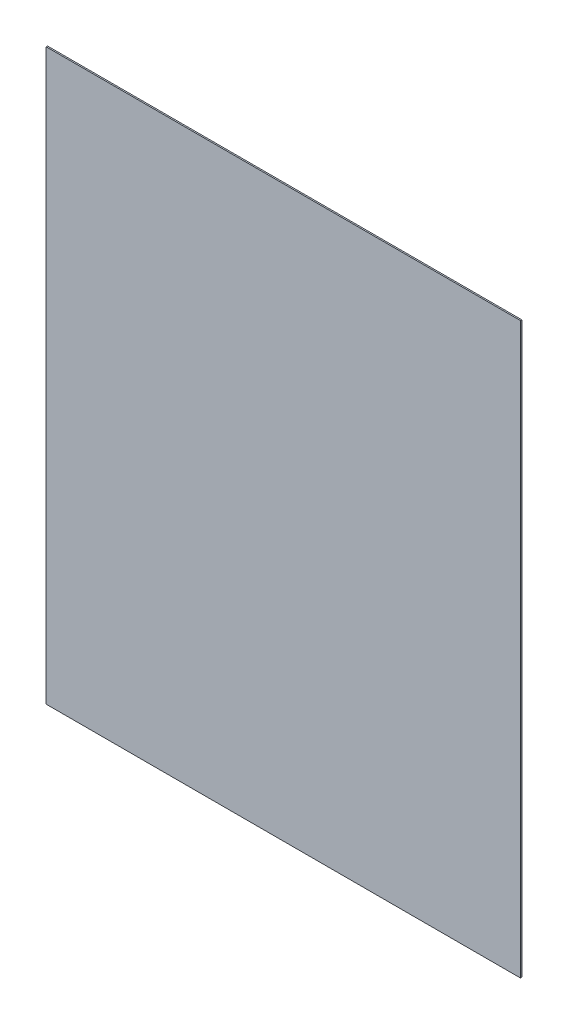
ISO-10303-21;
HEADER;
FILE_DESCRIPTION(('STEP AP214'),'2;1');
FILE_NAME('part.step','',(''),(''),'','','');
FILE_SCHEMA(('AUTOMOTIVE_DESIGN { 1 0 10303 214 1 1 1 1 }'));
ENDSEC;
DATA;
#1=APPLICATION_CONTEXT('core data for automotive mechanical design processes');
#2=APPLICATION_PROTOCOL_DEFINITION('international standard','automotive_design',2000,#1);
#3=PRODUCT_CONTEXT('',#1,'mechanical');
#4=PRODUCT('Part','Part','',(#3));
#5=PRODUCT_RELATED_PRODUCT_CATEGORY('part','',(#4));
#6=PRODUCT_DEFINITION_FORMATION('','',#4);
#7=PRODUCT_DEFINITION_CONTEXT('part definition',#1,'design');
#8=PRODUCT_DEFINITION('design','',#6,#7);
#9=PRODUCT_DEFINITION_SHAPE('','',#8);
#10=(LENGTH_UNIT() NAMED_UNIT(*) SI_UNIT(.MILLI.,.METRE.));
#11=(NAMED_UNIT(*) PLANE_ANGLE_UNIT() SI_UNIT($,.RADIAN.));
#12=(NAMED_UNIT(*) SI_UNIT($,.STERADIAN.) SOLID_ANGLE_UNIT());
#13=UNCERTAINTY_MEASURE_WITH_UNIT(LENGTH_MEASURE(1.E-05),#10,'distance_accuracy_value','');
#14=(GEOMETRIC_REPRESENTATION_CONTEXT(3) GLOBAL_UNCERTAINTY_ASSIGNED_CONTEXT((#13)) GLOBAL_UNIT_ASSIGNED_CONTEXT((#10,
#11,#12)) REPRESENTATION_CONTEXT('',''));
#15=CARTESIAN_POINT('',(0.,0.,0.));
#16=DIRECTION('',(0.,0.,1.));
#17=DIRECTION('',(1.,0.,0.));
#18=AXIS2_PLACEMENT_3D('',#15,#16,#17);
#19=CARTESIAN_POINT('',(0.,0.,0.));
#20=DIRECTION('',(0.,0.,-1.));
#21=DIRECTION('',(-1.,0.,0.));
#22=AXIS2_PLACEMENT_3D('',#19,#20,#21);
#23=PLANE('',#22);
#24=DIRECTION('',(0.,-1.,0.));
#25=VECTOR('',#24,1.);
#26=CARTESIAN_POINT('',(6.98000000107208,8.38000000170986,0.));
#27=LINE('',#26,#25);
#28=CARTESIAN_POINT('',(6.98000000107208,8.38000000170986,0.));
#29=VERTEX_POINT('',#28);
#30=CARTESIAN_POINT('',(6.98000000107195,0.,0.));
#31=VERTEX_POINT('',#30);
#32=EDGE_CURVE('E54',#29,#31,#27,.T.);
#33=ORIENTED_EDGE('',*,*,#32,.T.);
#34=DIRECTION('',(-1.,0.,0.));
#35=VECTOR('',#34,1.);
#36=CARTESIAN_POINT('',(6.98000000107191,0.,0.));
#37=LINE('',#36,#35);
#38=CARTESIAN_POINT('',(0.,0.,0.));
#39=VERTEX_POINT('',#38);
#40=EDGE_CURVE('E75',#31,#39,#37,.T.);
#41=ORIENTED_EDGE('',*,*,#40,.T.);
#42=DIRECTION('',(0.,1.,0.));
#43=VECTOR('',#42,1.);
#44=CARTESIAN_POINT('',(0.,0.,0.));
#45=LINE('',#44,#43);
#46=CARTESIAN_POINT('',(1.1539214028744E-13,8.38000000170986,0.));
#47=VERTEX_POINT('',#46);
#48=EDGE_CURVE('E57',#39,#47,#45,.T.);
#49=ORIENTED_EDGE('',*,*,#48,.T.);
#50=DIRECTION('',(1.,0.,0.));
#51=VECTOR('',#50,1.);
#52=CARTESIAN_POINT('',(1.53704604599625E-13,8.38000000170986,0.));
#53=LINE('',#52,#51);
#54=EDGE_CURVE('E19',#47,#29,#53,.T.);
#55=ORIENTED_EDGE('',*,*,#54,.T.);
#56=EDGE_LOOP('',(#33,#41,#49,#55));
#57=FACE_BOUND('',#56,.T.);
#58=ADVANCED_FACE('F16',(#57),#23,.T.);
#59=CARTESIAN_POINT('',(1.53704604599625E-13,8.38000000170986,0.02));
#60=DIRECTION('',(0.,-1.,0.));
#61=DIRECTION('',(0.,0.,-1.));
#62=AXIS2_PLACEMENT_3D('',#59,#60,#61);
#63=PLANE('',#62);
#64=DIRECTION('',(0.,0.,1.));
#65=VECTOR('',#64,1.);
#66=CARTESIAN_POINT('',(1.53704604599625E-13,8.38000000170986,0.02));
#67=LINE('',#66,#65);
#68=CARTESIAN_POINT('',(1.1539214028744E-13,8.38000000170986,0.02));
#69=VERTEX_POINT('',#68);
#70=EDGE_CURVE('E77',#47,#69,#67,.T.);
#71=ORIENTED_EDGE('',*,*,#70,.T.);
#72=DIRECTION('',(-1.,0.,0.));
#73=VECTOR('',#72,1.);
#74=CARTESIAN_POINT('',(0.,8.38000000170986,0.02));
#75=LINE('',#74,#73);
#76=CARTESIAN_POINT('',(6.98000000107208,8.38000000170986,0.02));
#77=VERTEX_POINT('',#76);
#78=EDGE_CURVE('E72',#69,#77,#75,.F.);
#79=ORIENTED_EDGE('',*,*,#78,.T.);
#80=DIRECTION('',(0.,0.,1.));
#81=VECTOR('',#80,1.);
#82=CARTESIAN_POINT('',(6.98000000107208,8.38000000170986,0.02));
#83=LINE('',#82,#81);
#84=EDGE_CURVE('E62',#77,#29,#83,.F.);
#85=ORIENTED_EDGE('',*,*,#84,.T.);
#86=ORIENTED_EDGE('',*,*,#54,.F.);
#87=EDGE_LOOP('',(#71,#79,#85,#86));
#88=FACE_BOUND('',#87,.T.);
#89=ADVANCED_FACE('F71',(#88),#63,.F.);
#90=CARTESIAN_POINT('',(6.98000000107208,8.38000000170986,0.02));
#91=DIRECTION('',(-1.,0.,0.));
#92=DIRECTION('',(0.,-1.,0.));
#93=AXIS2_PLACEMENT_3D('',#90,#91,#92);
#94=PLANE('',#93);
#95=ORIENTED_EDGE('',*,*,#84,.F.);
#96=DIRECTION('',(0.,1.,0.));
#97=VECTOR('',#96,1.);
#98=CARTESIAN_POINT('',(6.98000000107208,0.,0.02));
#99=LINE('',#98,#97);
#100=CARTESIAN_POINT('',(6.98000000107195,0.,0.02));
#101=VERTEX_POINT('',#100);
#102=EDGE_CURVE('E82',#77,#101,#99,.F.);
#103=ORIENTED_EDGE('',*,*,#102,.T.);
#104=DIRECTION('',(0.,0.,1.));
#105=VECTOR('',#104,1.);
#106=CARTESIAN_POINT('',(6.98000000107191,0.,0.02));
#107=LINE('',#106,#105);
#108=EDGE_CURVE('E68',#101,#31,#107,.F.);
#109=ORIENTED_EDGE('',*,*,#108,.T.);
#110=ORIENTED_EDGE('',*,*,#32,.F.);
#111=EDGE_LOOP('',(#95,#103,#109,#110));
#112=FACE_BOUND('',#111,.T.);
#113=ADVANCED_FACE('F65',(#112),#94,.F.);
#114=CARTESIAN_POINT('',(6.98000000107191,0.,0.02));
#115=DIRECTION('',(0.,1.,0.));
#116=DIRECTION('',(-1.,0.,0.));
#117=AXIS2_PLACEMENT_3D('',#114,#115,#116);
#118=PLANE('',#117);
#119=ORIENTED_EDGE('',*,*,#108,.F.);
#120=DIRECTION('',(-1.,0.,0.));
#121=VECTOR('',#120,1.);
#122=CARTESIAN_POINT('',(0.,0.,0.02));
#123=LINE('',#122,#121);
#124=CARTESIAN_POINT('',(0.,0.,0.02));
#125=VERTEX_POINT('',#124);
#126=EDGE_CURVE('E25',#101,#125,#123,.T.);
#127=ORIENTED_EDGE('',*,*,#126,.T.);
#128=DIRECTION('',(0.,0.,1.));
#129=VECTOR('',#128,1.);
#130=CARTESIAN_POINT('',(0.,0.,0.02));
#131=LINE('',#130,#129);
#132=EDGE_CURVE('E33',#125,#39,#131,.F.);
#133=ORIENTED_EDGE('',*,*,#132,.T.);
#134=ORIENTED_EDGE('',*,*,#40,.F.);
#135=EDGE_LOOP('',(#119,#127,#133,#134));
#136=FACE_BOUND('',#135,.T.);
#137=ADVANCED_FACE('F87',(#136),#118,.F.);
#138=CARTESIAN_POINT('',(0.,0.,0.02));
#139=DIRECTION('',(1.,0.,0.));
#140=DIRECTION('',(0.,1.,0.));
#141=AXIS2_PLACEMENT_3D('',#138,#139,#140);
#142=PLANE('',#141);
#143=ORIENTED_EDGE('',*,*,#132,.F.);
#144=DIRECTION('',(0.,1.,0.));
#145=VECTOR('',#144,1.);
#146=CARTESIAN_POINT('',(0.,0.,0.02));
#147=LINE('',#146,#145);
#148=EDGE_CURVE('E10',#125,#69,#147,.T.);
#149=ORIENTED_EDGE('',*,*,#148,.T.);
#150=ORIENTED_EDGE('',*,*,#70,.F.);
#151=ORIENTED_EDGE('',*,*,#48,.F.);
#152=EDGE_LOOP('',(#143,#149,#150,#151));
#153=FACE_BOUND('',#152,.T.);
#154=ADVANCED_FACE('F90',(#153),#142,.F.);
#155=CARTESIAN_POINT('',(0.,0.,0.02));
#156=DIRECTION('',(0.,0.,-1.));
#157=DIRECTION('',(-1.,0.,0.));
#158=AXIS2_PLACEMENT_3D('',#155,#156,#157);
#159=PLANE('',#158);
#160=ORIENTED_EDGE('',*,*,#126,.F.);
#161=ORIENTED_EDGE('',*,*,#102,.F.);
#162=ORIENTED_EDGE('',*,*,#78,.F.);
#163=ORIENTED_EDGE('',*,*,#148,.F.);
#164=EDGE_LOOP('',(#160,#161,#162,#163));
#165=FACE_BOUND('',#164,.T.);
#166=ADVANCED_FACE('F89',(#165),#159,.F.);
#167=CLOSED_SHELL('',(#58,#89,#113,#137,#154,#166));
#168=MANIFOLD_SOLID_BREP('B1',#167);
#169=ADVANCED_BREP_SHAPE_REPRESENTATION('',(#18,#168),#14);
#170=SHAPE_DEFINITION_REPRESENTATION(#9,#169);
ENDSEC;
END-ISO-10303-21;
